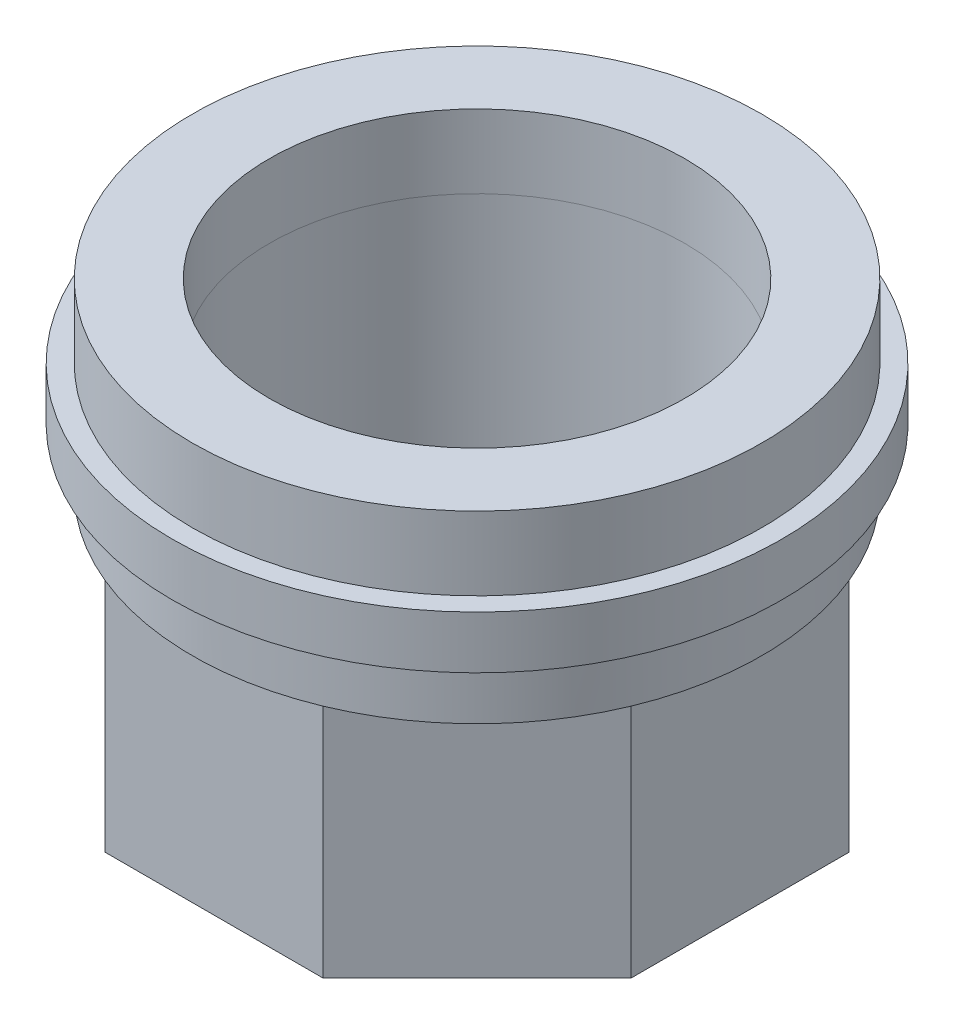
ISO-10303-21;
HEADER;
FILE_DESCRIPTION(('STEP AP214'),'2;1');
FILE_NAME('part.step','',(''),(''),'','','');
FILE_SCHEMA(('AUTOMOTIVE_DESIGN { 1 0 10303 214 1 1 1 1 }'));
ENDSEC;
DATA;
#1=APPLICATION_CONTEXT('core data for automotive mechanical design processes');
#2=APPLICATION_PROTOCOL_DEFINITION('international standard','automotive_design',2000,#1);
#3=PRODUCT_CONTEXT('',#1,'mechanical');
#4=PRODUCT('Part','Part','',(#3));
#5=PRODUCT_RELATED_PRODUCT_CATEGORY('part','',(#4));
#6=PRODUCT_DEFINITION_FORMATION('','',#4);
#7=PRODUCT_DEFINITION_CONTEXT('part definition',#1,'design');
#8=PRODUCT_DEFINITION('design','',#6,#7);
#9=PRODUCT_DEFINITION_SHAPE('','',#8);
#10=(LENGTH_UNIT() NAMED_UNIT(*) SI_UNIT(.MILLI.,.METRE.));
#11=(NAMED_UNIT(*) PLANE_ANGLE_UNIT() SI_UNIT($,.RADIAN.));
#12=(NAMED_UNIT(*) SI_UNIT($,.STERADIAN.) SOLID_ANGLE_UNIT());
#13=UNCERTAINTY_MEASURE_WITH_UNIT(LENGTH_MEASURE(1.E-05),#10,'distance_accuracy_value','');
#14=(GEOMETRIC_REPRESENTATION_CONTEXT(3) GLOBAL_UNCERTAINTY_ASSIGNED_CONTEXT((#13)) GLOBAL_UNIT_ASSIGNED_CONTEXT((#10,
#11,#12)) REPRESENTATION_CONTEXT('',''));
#15=CARTESIAN_POINT('',(0.,0.,0.));
#16=DIRECTION('',(0.,0.,1.));
#17=DIRECTION('',(1.,0.,0.));
#18=AXIS2_PLACEMENT_3D('',#15,#16,#17);
#19=CARTESIAN_POINT('',(0.,30.3,0.));
#20=DIRECTION('',(0.,1.,0.));
#21=DIRECTION('',(0.,0.,1.));
#22=AXIS2_PLACEMENT_3D('',#19,#20,#21);
#23=PLANE('',#22);
#24=CARTESIAN_POINT('',(0.,30.3,0.));
#25=DIRECTION('',(0.,1.,0.));
#26=DIRECTION('',(0.,0.,1.));
#27=AXIS2_PLACEMENT_3D('',#24,#25,#26);
#28=CIRCLE('',#27,20.5654518055555);
#29=CARTESIAN_POINT('',(0.,30.3,20.5654518055555));
#30=VERTEX_POINT('',#29);
#31=EDGE_CURVE('E11',#30,#30,#28,.T.);
#32=ORIENTED_EDGE('',*,*,#31,.T.);
#33=EDGE_LOOP('',(#32));
#34=FACE_BOUND('',#33,.T.);
#35=CARTESIAN_POINT('',(0.,30.3,0.));
#36=DIRECTION('',(0.,1.,0.));
#37=DIRECTION('',(0.,0.,1.));
#38=AXIS2_PLACEMENT_3D('',#35,#36,#37);
#39=CIRCLE('',#38,15.);
#40=CARTESIAN_POINT('',(0.,30.3,15.));
#41=VERTEX_POINT('',#40);
#42=EDGE_CURVE('E51',#41,#41,#39,.T.);
#43=ORIENTED_EDGE('',*,*,#42,.F.);
#44=EDGE_LOOP('',(#43));
#45=FACE_BOUND('',#44,.T.);
#46=ADVANCED_FACE('F40',(#34,#45),#23,.T.);
#47=CARTESIAN_POINT('',(0.,25.,0.));
#48=DIRECTION('',(0.,1.,0.));
#49=DIRECTION('',(0.,0.,1.));
#50=AXIS2_PLACEMENT_3D('',#47,#48,#49);
#51=PLANE('',#50);
#52=CARTESIAN_POINT('',(0.,25.,0.));
#53=DIRECTION('',(0.,1.,0.));
#54=DIRECTION('',(0.,0.,1.));
#55=AXIS2_PLACEMENT_3D('',#52,#53,#54);
#56=CIRCLE('',#55,20.5654518055555);
#57=CARTESIAN_POINT('',(0.,25.,20.5654518055555));
#58=VERTEX_POINT('',#57);
#59=EDGE_CURVE('E44',#58,#58,#56,.T.);
#60=ORIENTED_EDGE('',*,*,#59,.F.);
#61=EDGE_LOOP('',(#60));
#62=FACE_BOUND('',#61,.T.);
#63=CARTESIAN_POINT('',(0.,25.,0.));
#64=DIRECTION('',(0.,1.,0.));
#65=DIRECTION('',(0.,0.,1.));
#66=AXIS2_PLACEMENT_3D('',#63,#64,#65);
#67=CIRCLE('',#66,15.);
#68=CARTESIAN_POINT('',(0.,25.,15.));
#69=VERTEX_POINT('',#68);
#70=EDGE_CURVE('E53',#69,#69,#67,.T.);
#71=ORIENTED_EDGE('',*,*,#70,.T.);
#72=EDGE_LOOP('',(#71));
#73=FACE_BOUND('',#72,.T.);
#74=ADVANCED_FACE('F63',(#62,#73),#51,.F.);
#75=CARTESIAN_POINT('',(0.,30.3,0.));
#76=DIRECTION('',(0.,-1.,0.));
#77=DIRECTION('',(0.,0.,-1.));
#78=AXIS2_PLACEMENT_3D('',#75,#76,#77);
#79=CYLINDRICAL_SURFACE('',#78,20.5654518055555);
#80=ORIENTED_EDGE('',*,*,#31,.F.);
#81=EDGE_LOOP('',(#80));
#82=FACE_BOUND('',#81,.T.);
#83=ORIENTED_EDGE('',*,*,#59,.T.);
#84=EDGE_LOOP('',(#83));
#85=FACE_BOUND('',#84,.T.);
#86=ADVANCED_FACE('F42',(#82,#85),#79,.T.);
#87=CARTESIAN_POINT('',(0.,30.3,0.));
#88=DIRECTION('',(0.,-1.,0.));
#89=DIRECTION('',(0.,0.,-1.));
#90=AXIS2_PLACEMENT_3D('',#87,#88,#89);
#91=CYLINDRICAL_SURFACE('',#90,15.);
#92=ORIENTED_EDGE('',*,*,#42,.T.);
#93=EDGE_LOOP('',(#92));
#94=FACE_BOUND('',#93,.T.);
#95=ORIENTED_EDGE('',*,*,#70,.F.);
#96=EDGE_LOOP('',(#95));
#97=FACE_BOUND('',#96,.T.);
#98=ADVANCED_FACE('F59',(#94,#97),#91,.F.);
#99=CLOSED_SHELL('',(#46,#74,#86,#98));
#100=MANIFOLD_SOLID_BREP('B2',#99);
#101=CARTESIAN_POINT('',(0.,0.,0.));
#102=DIRECTION('',(0.,1.,0.));
#103=DIRECTION('',(0.,0.,1.));
#104=AXIS2_PLACEMENT_3D('',#101,#102,#103);
#105=PLANE('',#104);
#106=DIRECTION('',(1.,0.,0.));
#107=VECTOR('',#106,1.);
#108=CARTESIAN_POINT('',(-7.87005768508881,0.,19.));
#109=LINE('',#108,#107);
#110=CARTESIAN_POINT('',(-7.87005768508881,0.,19.));
#111=VERTEX_POINT('',#110);
#112=CARTESIAN_POINT('',(7.87005768508881,0.,19.));
#113=VERTEX_POINT('',#112);
#114=EDGE_CURVE('E226',#111,#113,#109,.T.);
#115=ORIENTED_EDGE('',*,*,#114,.F.);
#116=DIRECTION('',(0.707106781186548,0.,0.707106781186547));
#117=VECTOR('',#116,1.);
#118=CARTESIAN_POINT('',(-19.,0.,7.87005768508881));
#119=LINE('',#118,#117);
#120=CARTESIAN_POINT('',(-19.,0.,7.87005768508881));
#121=VERTEX_POINT('',#120);
#122=EDGE_CURVE('E152',#121,#111,#119,.T.);
#123=ORIENTED_EDGE('',*,*,#122,.F.);
#124=DIRECTION('',(0.,0.,1.));
#125=VECTOR('',#124,1.);
#126=CARTESIAN_POINT('',(-19.,0.,-7.87005768508881));
#127=LINE('',#126,#125);
#128=CARTESIAN_POINT('',(-19.,0.,-7.87005768508881));
#129=VERTEX_POINT('',#128);
#130=EDGE_CURVE('E146',#129,#121,#127,.T.);
#131=ORIENTED_EDGE('',*,*,#130,.F.);
#132=DIRECTION('',(-0.707106781186547,0.,0.707106781186548));
#133=VECTOR('',#132,1.);
#134=CARTESIAN_POINT('',(-7.87005768508882,0.,-19.));
#135=LINE('',#134,#133);
#136=CARTESIAN_POINT('',(-7.87005768508882,0.,-19.));
#137=VERTEX_POINT('',#136);
#138=EDGE_CURVE('E250',#137,#129,#135,.T.);
#139=ORIENTED_EDGE('',*,*,#138,.F.);
#140=DIRECTION('',(-1.,0.,0.));
#141=VECTOR('',#140,1.);
#142=CARTESIAN_POINT('',(7.87005768508879,0.,-19.));
#143=LINE('',#142,#141);
#144=CARTESIAN_POINT('',(7.87005768508879,0.,-19.));
#145=VERTEX_POINT('',#144);
#146=EDGE_CURVE('E182',#145,#137,#143,.T.);
#147=ORIENTED_EDGE('',*,*,#146,.F.);
#148=DIRECTION('',(-0.707106781186548,0.,-0.707106781186547));
#149=VECTOR('',#148,1.);
#150=CARTESIAN_POINT('',(19.,0.,-7.8700576850888));
#151=LINE('',#150,#149);
#152=CARTESIAN_POINT('',(19.,0.,-7.8700576850888));
#153=VERTEX_POINT('',#152);
#154=EDGE_CURVE('E247',#153,#145,#151,.T.);
#155=ORIENTED_EDGE('',*,*,#154,.F.);
#156=DIRECTION('',(0.,0.,-1.));
#157=VECTOR('',#156,1.);
#158=CARTESIAN_POINT('',(19.,0.,7.8700576850888));
#159=LINE('',#158,#157);
#160=CARTESIAN_POINT('',(19.,0.,7.8700576850888));
#161=VERTEX_POINT('',#160);
#162=EDGE_CURVE('E245',#161,#153,#159,.T.);
#163=ORIENTED_EDGE('',*,*,#162,.F.);
#164=DIRECTION('',(0.707106781186547,0.,-0.707106781186548));
#165=VECTOR('',#164,1.);
#166=CARTESIAN_POINT('',(7.87005768508881,0.,19.));
#167=LINE('',#166,#165);
#168=EDGE_CURVE('E243',#113,#161,#167,.T.);
#169=ORIENTED_EDGE('',*,*,#168,.F.);
#170=EDGE_LOOP('',(#115,#123,#131,#139,#147,#155,#163,#169));
#171=FACE_BOUND('',#170,.T.);
#172=CARTESIAN_POINT('',(0.,0.,0.));
#173=DIRECTION('',(0.,1.,0.));
#174=DIRECTION('',(0.,0.,1.));
#175=AXIS2_PLACEMENT_3D('',#172,#173,#174);
#176=CIRCLE('',#175,15.);
#177=CARTESIAN_POINT('',(0.,0.,15.));
#178=VERTEX_POINT('',#177);
#179=EDGE_CURVE('E223',#178,#178,#176,.T.);
#180=ORIENTED_EDGE('',*,*,#179,.T.);
#181=EDGE_LOOP('',(#180));
#182=FACE_BOUND('',#181,.T.);
#183=ADVANCED_FACE('F101',(#171,#182),#105,.F.);
#184=CARTESIAN_POINT('',(-7.87005768508881,17.,19.));
#185=DIRECTION('',(0.,0.,-1.));
#186=DIRECTION('',(-1.,0.,0.));
#187=AXIS2_PLACEMENT_3D('',#184,#185,#186);
#188=PLANE('',#187);
#189=ORIENTED_EDGE('',*,*,#114,.T.);
#190=DIRECTION('',(0.,-1.,0.));
#191=VECTOR('',#190,1.);
#192=CARTESIAN_POINT('',(7.87005768508881,17.,19.));
#193=LINE('',#192,#191);
#194=CARTESIAN_POINT('',(7.87005768508881,17.,19.));
#195=VERTEX_POINT('',#194);
#196=EDGE_CURVE('E38',#195,#113,#193,.T.);
#197=ORIENTED_EDGE('',*,*,#196,.F.);
#198=DIRECTION('',(1.,0.,0.));
#199=VECTOR('',#198,1.);
#200=CARTESIAN_POINT('',(-7.87005768508881,17.,19.));
#201=LINE('',#200,#199);
#202=CARTESIAN_POINT('',(-7.87005768508879,17.,19.));
#203=VERTEX_POINT('',#202);
#204=EDGE_CURVE('E227',#203,#195,#201,.T.);
#205=ORIENTED_EDGE('',*,*,#204,.F.);
#206=DIRECTION('',(0.,-1.,0.));
#207=VECTOR('',#206,1.);
#208=CARTESIAN_POINT('',(-7.87005768508881,17.,19.));
#209=LINE('',#208,#207);
#210=EDGE_CURVE('E240',#203,#111,#209,.T.);
#211=ORIENTED_EDGE('',*,*,#210,.T.);
#212=EDGE_LOOP('',(#189,#197,#205,#211));
#213=FACE_BOUND('',#212,.T.);
#214=ADVANCED_FACE('F103',(#213),#188,.F.);
#215=CARTESIAN_POINT('',(7.87005768508881,17.,19.));
#216=DIRECTION('',(-0.707106781186548,0.,-0.707106781186547));
#217=DIRECTION('',(-0.707106781186547,0.,0.707106781186548));
#218=AXIS2_PLACEMENT_3D('',#215,#216,#217);
#219=PLANE('',#218);
#220=ORIENTED_EDGE('',*,*,#168,.T.);
#221=DIRECTION('',(0.,-1.,0.));
#222=VECTOR('',#221,1.);
#223=CARTESIAN_POINT('',(19.,17.,7.8700576850888));
#224=LINE('',#223,#222);
#225=CARTESIAN_POINT('',(19.,17.,7.8700576850888));
#226=VERTEX_POINT('',#225);
#227=EDGE_CURVE('E110',#226,#161,#224,.T.);
#228=ORIENTED_EDGE('',*,*,#227,.F.);
#229=DIRECTION('',(0.707106781186547,0.,-0.707106781186548));
#230=VECTOR('',#229,1.);
#231=CARTESIAN_POINT('',(7.87005768508881,17.,19.));
#232=LINE('',#231,#230);
#233=EDGE_CURVE('E160',#195,#226,#232,.T.);
#234=ORIENTED_EDGE('',*,*,#233,.F.);
#235=ORIENTED_EDGE('',*,*,#196,.T.);
#236=EDGE_LOOP('',(#220,#228,#234,#235));
#237=FACE_BOUND('',#236,.T.);
#238=ADVANCED_FACE('F300',(#237),#219,.F.);
#239=CARTESIAN_POINT('',(19.,17.,7.8700576850888));
#240=DIRECTION('',(-1.,0.,0.));
#241=DIRECTION('',(0.,0.,1.));
#242=AXIS2_PLACEMENT_3D('',#239,#240,#241);
#243=PLANE('',#242);
#244=ORIENTED_EDGE('',*,*,#162,.T.);
#245=DIRECTION('',(0.,-1.,0.));
#246=VECTOR('',#245,1.);
#247=CARTESIAN_POINT('',(19.,17.,-7.8700576850888));
#248=LINE('',#247,#246);
#249=CARTESIAN_POINT('',(19.,17.,-7.8700576850888));
#250=VERTEX_POINT('',#249);
#251=EDGE_CURVE('E258',#250,#153,#248,.T.);
#252=ORIENTED_EDGE('',*,*,#251,.F.);
#253=DIRECTION('',(0.,0.,-1.));
#254=VECTOR('',#253,1.);
#255=CARTESIAN_POINT('',(19.,17.,7.8700576850888));
#256=LINE('',#255,#254);
#257=EDGE_CURVE('E231',#226,#250,#256,.T.);
#258=ORIENTED_EDGE('',*,*,#257,.F.);
#259=ORIENTED_EDGE('',*,*,#227,.T.);
#260=EDGE_LOOP('',(#244,#252,#258,#259));
#261=FACE_BOUND('',#260,.T.);
#262=ADVANCED_FACE('F264',(#261),#243,.F.);
#263=CARTESIAN_POINT('',(19.,17.,-7.8700576850888));
#264=DIRECTION('',(-0.707106781186547,0.,0.707106781186548));
#265=DIRECTION('',(0.707106781186548,0.,0.707106781186547));
#266=AXIS2_PLACEMENT_3D('',#263,#264,#265);
#267=PLANE('',#266);
#268=ORIENTED_EDGE('',*,*,#154,.T.);
#269=DIRECTION('',(0.,-1.,0.));
#270=VECTOR('',#269,1.);
#271=CARTESIAN_POINT('',(7.87005768508879,17.,-19.));
#272=LINE('',#271,#270);
#273=CARTESIAN_POINT('',(7.87005768508879,17.,-19.));
#274=VERTEX_POINT('',#273);
#275=EDGE_CURVE('E185',#274,#145,#272,.T.);
#276=ORIENTED_EDGE('',*,*,#275,.F.);
#277=DIRECTION('',(-0.707106781186548,0.,-0.707106781186547));
#278=VECTOR('',#277,1.);
#279=CARTESIAN_POINT('',(19.,17.,-7.8700576850888));
#280=LINE('',#279,#278);
#281=EDGE_CURVE('E202',#250,#274,#280,.T.);
#282=ORIENTED_EDGE('',*,*,#281,.F.);
#283=ORIENTED_EDGE('',*,*,#251,.T.);
#284=EDGE_LOOP('',(#268,#276,#282,#283));
#285=FACE_BOUND('',#284,.T.);
#286=ADVANCED_FACE('F270',(#285),#267,.F.);
#287=CARTESIAN_POINT('',(7.87005768508879,17.,-19.));
#288=DIRECTION('',(0.,0.,1.));
#289=DIRECTION('',(1.,0.,0.));
#290=AXIS2_PLACEMENT_3D('',#287,#288,#289);
#291=PLANE('',#290);
#292=ORIENTED_EDGE('',*,*,#146,.T.);
#293=DIRECTION('',(0.,-1.,0.));
#294=VECTOR('',#293,1.);
#295=CARTESIAN_POINT('',(-7.87005768508882,17.,-19.));
#296=LINE('',#295,#294);
#297=CARTESIAN_POINT('',(-7.87005768508882,17.,-19.));
#298=VERTEX_POINT('',#297);
#299=EDGE_CURVE('E174',#298,#137,#296,.T.);
#300=ORIENTED_EDGE('',*,*,#299,.F.);
#301=DIRECTION('',(-1.,0.,0.));
#302=VECTOR('',#301,1.);
#303=CARTESIAN_POINT('',(7.87005768508879,17.,-19.));
#304=LINE('',#303,#302);
#305=EDGE_CURVE('E179',#274,#298,#304,.T.);
#306=ORIENTED_EDGE('',*,*,#305,.F.);
#307=ORIENTED_EDGE('',*,*,#275,.T.);
#308=EDGE_LOOP('',(#292,#300,#306,#307));
#309=FACE_BOUND('',#308,.T.);
#310=ADVANCED_FACE('F176',(#309),#291,.F.);
#311=CARTESIAN_POINT('',(-7.87005768508882,17.,-19.));
#312=DIRECTION('',(0.707106781186548,0.,0.707106781186547));
#313=DIRECTION('',(0.707106781186547,0.,-0.707106781186548));
#314=AXIS2_PLACEMENT_3D('',#311,#312,#313);
#315=PLANE('',#314);
#316=ORIENTED_EDGE('',*,*,#138,.T.);
#317=DIRECTION('',(0.,-1.,0.));
#318=VECTOR('',#317,1.);
#319=CARTESIAN_POINT('',(-19.,17.,-7.87005768508881));
#320=LINE('',#319,#318);
#321=CARTESIAN_POINT('',(-19.,17.,-7.87005768508881));
#322=VERTEX_POINT('',#321);
#323=EDGE_CURVE('E186',#322,#129,#320,.T.);
#324=ORIENTED_EDGE('',*,*,#323,.F.);
#325=DIRECTION('',(-0.707106781186547,0.,0.707106781186548));
#326=VECTOR('',#325,1.);
#327=CARTESIAN_POINT('',(-7.87005768508882,17.,-19.));
#328=LINE('',#327,#326);
#329=EDGE_CURVE('E189',#298,#322,#328,.T.);
#330=ORIENTED_EDGE('',*,*,#329,.F.);
#331=ORIENTED_EDGE('',*,*,#299,.T.);
#332=EDGE_LOOP('',(#316,#324,#330,#331));
#333=FACE_BOUND('',#332,.T.);
#334=ADVANCED_FACE('F190',(#333),#315,.F.);
#335=CARTESIAN_POINT('',(-19.,17.,-7.87005768508881));
#336=DIRECTION('',(1.,0.,0.));
#337=DIRECTION('',(0.,0.,-1.));
#338=AXIS2_PLACEMENT_3D('',#335,#336,#337);
#339=PLANE('',#338);
#340=ORIENTED_EDGE('',*,*,#130,.T.);
#341=DIRECTION('',(0.,-1.,0.));
#342=VECTOR('',#341,1.);
#343=CARTESIAN_POINT('',(-19.,17.,7.87005768508881));
#344=LINE('',#343,#342);
#345=CARTESIAN_POINT('',(-19.,17.,7.87005768508881));
#346=VERTEX_POINT('',#345);
#347=EDGE_CURVE('E118',#346,#121,#344,.T.);
#348=ORIENTED_EDGE('',*,*,#347,.F.);
#349=DIRECTION('',(0.,0.,1.));
#350=VECTOR('',#349,1.);
#351=CARTESIAN_POINT('',(-19.,17.,-7.87005768508881));
#352=LINE('',#351,#350);
#353=EDGE_CURVE('E194',#322,#346,#352,.T.);
#354=ORIENTED_EDGE('',*,*,#353,.F.);
#355=ORIENTED_EDGE('',*,*,#323,.T.);
#356=EDGE_LOOP('',(#340,#348,#354,#355));
#357=FACE_BOUND('',#356,.T.);
#358=ADVANCED_FACE('F307',(#357),#339,.F.);
#359=CARTESIAN_POINT('',(-19.,17.,7.87005768508881));
#360=DIRECTION('',(0.707106781186547,0.,-0.707106781186548));
#361=DIRECTION('',(-0.707106781186548,0.,-0.707106781186547));
#362=AXIS2_PLACEMENT_3D('',#359,#360,#361);
#363=PLANE('',#362);
#364=ORIENTED_EDGE('',*,*,#122,.T.);
#365=ORIENTED_EDGE('',*,*,#210,.F.);
#366=DIRECTION('',(0.707106781186548,0.,0.707106781186547));
#367=VECTOR('',#366,1.);
#368=CARTESIAN_POINT('',(-19.,17.,7.87005768508881));
#369=LINE('',#368,#367);
#370=EDGE_CURVE('E237',#346,#203,#369,.T.);
#371=ORIENTED_EDGE('',*,*,#370,.F.);
#372=ORIENTED_EDGE('',*,*,#347,.T.);
#373=EDGE_LOOP('',(#364,#365,#371,#372));
#374=FACE_BOUND('',#373,.T.);
#375=ADVANCED_FACE('F304',(#374),#363,.F.);
#376=CARTESIAN_POINT('',(0.,17.,0.));
#377=DIRECTION('',(0.,-1.,0.));
#378=DIRECTION('',(0.,0.,-1.));
#379=AXIS2_PLACEMENT_3D('',#376,#377,#378);
#380=CYLINDRICAL_SURFACE('',#379,15.);
#381=ORIENTED_EDGE('',*,*,#179,.F.);
#382=EDGE_LOOP('',(#381));
#383=FACE_BOUND('',#382,.T.);
#384=CARTESIAN_POINT('',(0.,25.,0.));
#385=DIRECTION('',(0.,1.,0.));
#386=DIRECTION('',(0.,0.,1.));
#387=AXIS2_PLACEMENT_3D('',#384,#385,#386);
#388=CIRCLE('',#387,15.);
#389=CARTESIAN_POINT('',(0.,25.,15.));
#390=VERTEX_POINT('',#389);
#391=EDGE_CURVE('E333',#390,#390,#388,.T.);
#392=ORIENTED_EDGE('',*,*,#391,.T.);
#393=EDGE_LOOP('',(#392));
#394=FACE_BOUND('',#393,.T.);
#395=ADVANCED_FACE('F290',(#383,#394),#380,.F.);
#396=CARTESIAN_POINT('',(0.,17.,0.));
#397=DIRECTION('',(0.,1.,0.));
#398=DIRECTION('',(0.,0.,1.));
#399=AXIS2_PLACEMENT_3D('',#396,#397,#398);
#400=PLANE('',#399);
#401=CARTESIAN_POINT('',(0.,17.,0.));
#402=DIRECTION('',(0.,1.,0.));
#403=DIRECTION('',(0.,0.,1.));
#404=AXIS2_PLACEMENT_3D('',#401,#402,#403);
#405=CIRCLE('',#404,20.5654518055555);
#406=EDGE_CURVE('E221',#203,#195,#405,.T.);
#407=ORIENTED_EDGE('',*,*,#406,.F.);
#408=ORIENTED_EDGE('',*,*,#204,.T.);
#409=EDGE_LOOP('',(#407,#408));
#410=FACE_BOUND('',#409,.T.);
#411=ADVANCED_FACE('F284',(#410),#400,.F.);
#412=EDGE_CURVE('E217',#195,#226,#405,.T.);
#413=ORIENTED_EDGE('',*,*,#412,.F.);
#414=ORIENTED_EDGE('',*,*,#233,.T.);
#415=EDGE_LOOP('',(#413,#414));
#416=FACE_BOUND('',#415,.T.);
#417=ADVANCED_FACE('F282',(#416),#400,.F.);
#418=EDGE_CURVE('E216',#226,#250,#405,.T.);
#419=ORIENTED_EDGE('',*,*,#418,.F.);
#420=ORIENTED_EDGE('',*,*,#257,.T.);
#421=EDGE_LOOP('',(#419,#420));
#422=FACE_BOUND('',#421,.T.);
#423=ADVANCED_FACE('F275',(#422),#400,.F.);
#424=EDGE_CURVE('E215',#250,#274,#405,.T.);
#425=ORIENTED_EDGE('',*,*,#424,.F.);
#426=ORIENTED_EDGE('',*,*,#281,.T.);
#427=EDGE_LOOP('',(#425,#426));
#428=FACE_BOUND('',#427,.T.);
#429=ADVANCED_FACE('F276',(#428),#400,.F.);
#430=EDGE_CURVE('E200',#274,#298,#405,.T.);
#431=ORIENTED_EDGE('',*,*,#430,.F.);
#432=ORIENTED_EDGE('',*,*,#305,.T.);
#433=EDGE_LOOP('',(#431,#432));
#434=FACE_BOUND('',#433,.T.);
#435=ADVANCED_FACE('F198',(#434),#400,.F.);
#436=EDGE_CURVE('E205',#298,#322,#405,.T.);
#437=ORIENTED_EDGE('',*,*,#436,.F.);
#438=ORIENTED_EDGE('',*,*,#329,.T.);
#439=EDGE_LOOP('',(#437,#438));
#440=FACE_BOUND('',#439,.T.);
#441=ADVANCED_FACE('F206',(#440),#400,.F.);
#442=EDGE_CURVE('E209',#322,#346,#405,.T.);
#443=ORIENTED_EDGE('',*,*,#442,.F.);
#444=ORIENTED_EDGE('',*,*,#353,.T.);
#445=EDGE_LOOP('',(#443,#444));
#446=FACE_BOUND('',#445,.T.);
#447=ADVANCED_FACE('F323',(#446),#400,.F.);
#448=EDGE_CURVE('E325',#346,#203,#405,.T.);
#449=ORIENTED_EDGE('',*,*,#448,.F.);
#450=ORIENTED_EDGE('',*,*,#370,.T.);
#451=EDGE_LOOP('',(#449,#450));
#452=FACE_BOUND('',#451,.T.);
#453=ADVANCED_FACE('F292',(#452),#400,.F.);
#454=CARTESIAN_POINT('',(0.,21.2,0.));
#455=DIRECTION('',(0.,-1.,0.));
#456=DIRECTION('',(0.,0.,-1.));
#457=AXIS2_PLACEMENT_3D('',#454,#455,#456);
#458=CYLINDRICAL_SURFACE('',#457,20.5654518055555);
#459=CARTESIAN_POINT('',(0.,21.2,0.));
#460=DIRECTION('',(0.,1.,0.));
#461=DIRECTION('',(0.,0.,1.));
#462=AXIS2_PLACEMENT_3D('',#459,#460,#461);
#463=CIRCLE('',#462,20.5654518055555);
#464=CARTESIAN_POINT('',(0.,21.2,20.5654518055555));
#465=VERTEX_POINT('',#464);
#466=EDGE_CURVE('E220',#465,#465,#463,.T.);
#467=ORIENTED_EDGE('',*,*,#466,.F.);
#468=EDGE_LOOP('',(#467));
#469=FACE_BOUND('',#468,.T.);
#470=ORIENTED_EDGE('',*,*,#412,.T.);
#471=ORIENTED_EDGE('',*,*,#418,.T.);
#472=ORIENTED_EDGE('',*,*,#424,.T.);
#473=ORIENTED_EDGE('',*,*,#430,.T.);
#474=ORIENTED_EDGE('',*,*,#436,.T.);
#475=ORIENTED_EDGE('',*,*,#442,.T.);
#476=ORIENTED_EDGE('',*,*,#448,.T.);
#477=ORIENTED_EDGE('',*,*,#406,.T.);
#478=EDGE_LOOP('',(#470,#471,#472,#473,#474,#475,#476,#477));
#479=FACE_BOUND('',#478,.T.);
#480=ADVANCED_FACE('F212',(#469,#479),#458,.T.);
#481=CARTESIAN_POINT('',(0.,25.,0.));
#482=DIRECTION('',(0.,1.,0.));
#483=DIRECTION('',(0.,0.,1.));
#484=AXIS2_PLACEMENT_3D('',#481,#482,#483);
#485=PLANE('',#484);
#486=CARTESIAN_POINT('',(0.,25.,0.));
#487=DIRECTION('',(0.,1.,0.));
#488=DIRECTION('',(0.,0.,1.));
#489=AXIS2_PLACEMENT_3D('',#486,#487,#488);
#490=CIRCLE('',#489,22.);
#491=CARTESIAN_POINT('',(0.,25.,22.));
#492=VERTEX_POINT('',#491);
#493=EDGE_CURVE('E326',#492,#492,#490,.T.);
#494=ORIENTED_EDGE('',*,*,#493,.T.);
#495=EDGE_LOOP('',(#494));
#496=FACE_BOUND('',#495,.T.);
#497=ORIENTED_EDGE('',*,*,#391,.F.);
#498=EDGE_LOOP('',(#497));
#499=FACE_BOUND('',#498,.T.);
#500=ADVANCED_FACE('F339',(#496,#499),#485,.T.);
#501=CARTESIAN_POINT('',(0.,21.2,0.));
#502=DIRECTION('',(0.,1.,0.));
#503=DIRECTION('',(0.,0.,1.));
#504=AXIS2_PLACEMENT_3D('',#501,#502,#503);
#505=PLANE('',#504);
#506=ORIENTED_EDGE('',*,*,#466,.T.);
#507=EDGE_LOOP('',(#506));
#508=FACE_BOUND('',#507,.T.);
#509=CARTESIAN_POINT('',(0.,21.2,0.));
#510=DIRECTION('',(0.,1.,0.));
#511=DIRECTION('',(0.,0.,1.));
#512=AXIS2_PLACEMENT_3D('',#509,#510,#511);
#513=CIRCLE('',#512,22.);
#514=CARTESIAN_POINT('',(0.,21.2,22.));
#515=VERTEX_POINT('',#514);
#516=EDGE_CURVE('E328',#515,#515,#513,.T.);
#517=ORIENTED_EDGE('',*,*,#516,.F.);
#518=EDGE_LOOP('',(#517));
#519=FACE_BOUND('',#518,.T.);
#520=ADVANCED_FACE('F341',(#508,#519),#505,.F.);
#521=CARTESIAN_POINT('',(0.,25.,0.));
#522=DIRECTION('',(0.,-1.,0.));
#523=DIRECTION('',(0.,0.,-1.));
#524=AXIS2_PLACEMENT_3D('',#521,#522,#523);
#525=CYLINDRICAL_SURFACE('',#524,22.);
#526=ORIENTED_EDGE('',*,*,#493,.F.);
#527=EDGE_LOOP('',(#526));
#528=FACE_BOUND('',#527,.T.);
#529=ORIENTED_EDGE('',*,*,#516,.T.);
#530=EDGE_LOOP('',(#529));
#531=FACE_BOUND('',#530,.T.);
#532=ADVANCED_FACE('F347',(#528,#531),#525,.T.);
#533=CLOSED_SHELL('',(#183,#214,#238,#262,#286,#310,#334,#358,#375,#395,#411,#417,#423,#429,
#435,#441,#447,#453,#480,#500,#520,#532));
#534=MANIFOLD_SOLID_BREP('B6',#533);
#535=ADVANCED_BREP_SHAPE_REPRESENTATION('',(#18,#100,#534),#14);
#536=SHAPE_DEFINITION_REPRESENTATION(#9,#535);
ENDSEC;
END-ISO-10303-21;
